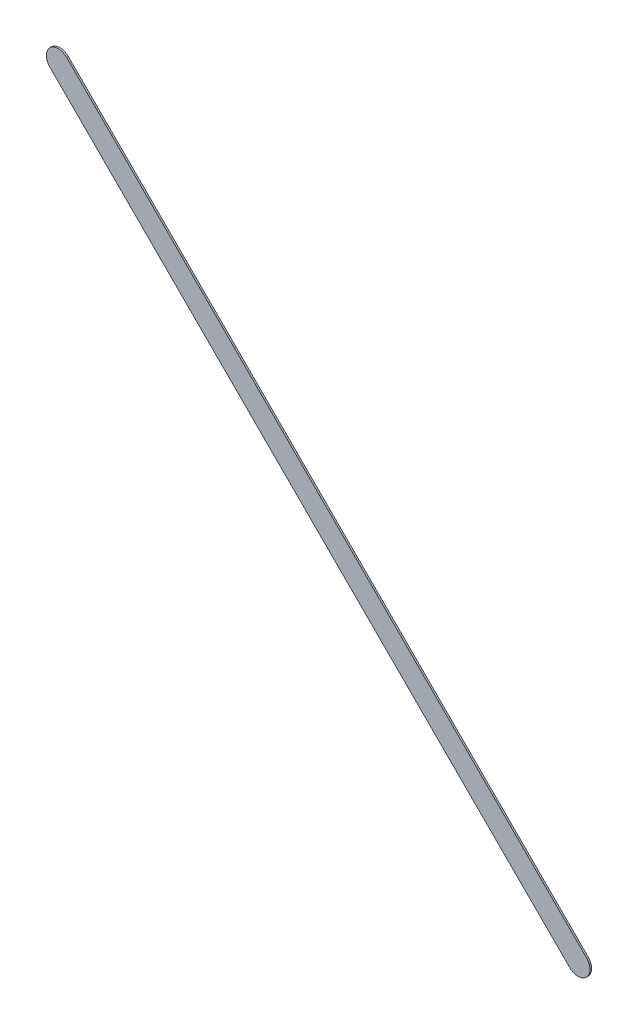
ISO-10303-21;
HEADER;
FILE_DESCRIPTION(('STEP AP214'),'2;1');
FILE_NAME('part.step','',(''),(''),'','','');
FILE_SCHEMA(('AUTOMOTIVE_DESIGN { 1 0 10303 214 1 1 1 1 }'));
ENDSEC;
DATA;
#1=APPLICATION_CONTEXT('core data for automotive mechanical design processes');
#2=APPLICATION_PROTOCOL_DEFINITION('international standard','automotive_design',2000,#1);
#3=PRODUCT_CONTEXT('',#1,'mechanical');
#4=PRODUCT('Part','Part','',(#3));
#5=PRODUCT_RELATED_PRODUCT_CATEGORY('part','',(#4));
#6=PRODUCT_DEFINITION_FORMATION('','',#4);
#7=PRODUCT_DEFINITION_CONTEXT('part definition',#1,'design');
#8=PRODUCT_DEFINITION('design','',#6,#7);
#9=PRODUCT_DEFINITION_SHAPE('','',#8);
#10=(LENGTH_UNIT() NAMED_UNIT(*) SI_UNIT(.MILLI.,.METRE.));
#11=(NAMED_UNIT(*) PLANE_ANGLE_UNIT() SI_UNIT($,.RADIAN.));
#12=(NAMED_UNIT(*) SI_UNIT($,.STERADIAN.) SOLID_ANGLE_UNIT());
#13=UNCERTAINTY_MEASURE_WITH_UNIT(LENGTH_MEASURE(1.E-05),#10,'distance_accuracy_value','');
#14=(GEOMETRIC_REPRESENTATION_CONTEXT(3) GLOBAL_UNCERTAINTY_ASSIGNED_CONTEXT((#13)) GLOBAL_UNIT_ASSIGNED_CONTEXT((#10,
#11,#12)) REPRESENTATION_CONTEXT('',''));
#15=CARTESIAN_POINT('',(0.,0.,0.));
#16=DIRECTION('',(0.,0.,1.));
#17=DIRECTION('',(1.,0.,0.));
#18=AXIS2_PLACEMENT_3D('',#15,#16,#17);
#19=CARTESIAN_POINT('',(163.498776,-116.790223,0.));
#20=DIRECTION('',(0.,0.,1.));
#21=DIRECTION('',(1.,0.,0.));
#22=AXIS2_PLACEMENT_3D('',#19,#20,#21);
#23=PLANE('',#22);
#24=DIRECTION('',(-0.707106781186548,0.707106781186548,0.));
#25=VECTOR('',#24,1.);
#26=CARTESIAN_POINT('',(163.498776,-116.790223,0.));
#27=LINE('',#26,#25);
#28=CARTESIAN_POINT('',(163.498776,-116.790223,0.));
#29=VERTEX_POINT('',#28);
#30=CARTESIAN_POINT('',(152.576776,-105.868223,0.));
#31=VERTEX_POINT('',#30);
#32=EDGE_CURVE('E85',#29,#31,#27,.T.);
#33=ORIENTED_EDGE('',*,*,#32,.T.);
#34=CARTESIAN_POINT('',(152.3999995,-106.0449995,0.));
#35=DIRECTION('',(0.,0.,1.));
#36=DIRECTION('',(0.707106781186548,0.707106781186548,0.));
#37=AXIS2_PLACEMENT_3D('',#34,#35,#36);
#38=CIRCLE('',#37,0.249999723809);
#39=CARTESIAN_POINT('',(152.223223,-106.221776,0.));
#40=VERTEX_POINT('',#39);
#41=EDGE_CURVE('E71',#31,#40,#38,.T.);
#42=ORIENTED_EDGE('',*,*,#41,.T.);
#43=DIRECTION('',(0.707106781186548,-0.707106781186548,0.));
#44=VECTOR('',#43,1.);
#45=CARTESIAN_POINT('',(152.223223,-106.221776,0.));
#46=LINE('',#45,#44);
#47=CARTESIAN_POINT('',(163.145223,-117.143776,0.));
#48=VERTEX_POINT('',#47);
#49=EDGE_CURVE('E106',#40,#48,#46,.T.);
#50=ORIENTED_EDGE('',*,*,#49,.T.);
#51=CARTESIAN_POINT('',(163.3219995,-116.9669995,0.));
#52=DIRECTION('',(0.,0.,1.));
#53=DIRECTION('',(-0.707106781186548,-0.707106781186548,0.));
#54=AXIS2_PLACEMENT_3D('',#51,#52,#53);
#55=CIRCLE('',#54,0.249999723809);
#56=EDGE_CURVE('E11',#48,#29,#55,.T.);
#57=ORIENTED_EDGE('',*,*,#56,.T.);
#58=EDGE_LOOP('',(#33,#42,#50,#57));
#59=FACE_BOUND('',#58,.T.);
#60=ADVANCED_FACE('F17',(#59),#23,.T.);
#61=CARTESIAN_POINT('',(163.498776,-116.790223,-0.035));
#62=DIRECTION('',(0.,0.,1.));
#63=DIRECTION('',(1.,0.,0.));
#64=AXIS2_PLACEMENT_3D('',#61,#62,#63);
#65=PLANE('',#64);
#66=CARTESIAN_POINT('',(163.3219995,-116.9669995,-0.035));
#67=DIRECTION('',(0.,0.,1.));
#68=DIRECTION('',(-0.707106781186548,-0.707106781186548,0.));
#69=AXIS2_PLACEMENT_3D('',#66,#67,#68);
#70=CIRCLE('',#69,0.249999723809);
#71=CARTESIAN_POINT('',(163.145223,-117.143776,-0.035));
#72=VERTEX_POINT('',#71);
#73=CARTESIAN_POINT('',(163.498776,-116.790223,-0.035));
#74=VERTEX_POINT('',#73);
#75=EDGE_CURVE('E20',#72,#74,#70,.T.);
#76=ORIENTED_EDGE('',*,*,#75,.F.);
#77=DIRECTION('',(0.707106781186548,-0.707106781186548,0.));
#78=VECTOR('',#77,1.);
#79=CARTESIAN_POINT('',(152.223223,-106.221776,-0.035));
#80=LINE('',#79,#78);
#81=CARTESIAN_POINT('',(152.223223,-106.221776,-0.035));
#82=VERTEX_POINT('',#81);
#83=EDGE_CURVE('E82',#82,#72,#80,.T.);
#84=ORIENTED_EDGE('',*,*,#83,.F.);
#85=CARTESIAN_POINT('',(152.3999995,-106.0449995,-0.035));
#86=DIRECTION('',(0.,0.,1.));
#87=DIRECTION('',(0.707106781186548,0.707106781186548,0.));
#88=AXIS2_PLACEMENT_3D('',#85,#86,#87);
#89=CIRCLE('',#88,0.249999723809);
#90=CARTESIAN_POINT('',(152.576776,-105.868223,-0.035));
#91=VERTEX_POINT('',#90);
#92=EDGE_CURVE('E109',#91,#82,#89,.T.);
#93=ORIENTED_EDGE('',*,*,#92,.F.);
#94=DIRECTION('',(-0.707106781186548,0.707106781186548,0.));
#95=VECTOR('',#94,1.);
#96=CARTESIAN_POINT('',(163.498776,-116.790223,-0.035));
#97=LINE('',#96,#95);
#98=EDGE_CURVE('E92',#74,#91,#97,.T.);
#99=ORIENTED_EDGE('',*,*,#98,.F.);
#100=EDGE_LOOP('',(#76,#84,#93,#99));
#101=FACE_BOUND('',#100,.T.);
#102=ADVANCED_FACE('F121',(#101),#65,.F.);
#103=CARTESIAN_POINT('',(163.3219995,-116.9669995,-0.035));
#104=DIRECTION('',(0.,0.,-1.));
#105=DIRECTION('',(-0.707106781186548,-0.707106781186548,0.));
#106=AXIS2_PLACEMENT_3D('',#103,#104,#105);
#107=CYLINDRICAL_SURFACE('',#106,0.249999723809);
#108=ORIENTED_EDGE('',*,*,#75,.T.);
#109=DIRECTION('',(0.,0.,1.));
#110=VECTOR('',#109,1.);
#111=CARTESIAN_POINT('',(163.498776,-116.790223,-0.035));
#112=LINE('',#111,#110);
#113=EDGE_CURVE('E89',#74,#29,#112,.T.);
#114=ORIENTED_EDGE('',*,*,#113,.T.);
#115=ORIENTED_EDGE('',*,*,#56,.F.);
#116=DIRECTION('',(0.,0.,1.));
#117=VECTOR('',#116,1.);
#118=CARTESIAN_POINT('',(163.145223,-117.143776,-0.035));
#119=LINE('',#118,#117);
#120=EDGE_CURVE('E102',#72,#48,#119,.T.);
#121=ORIENTED_EDGE('',*,*,#120,.F.);
#122=EDGE_LOOP('',(#108,#114,#115,#121));
#123=FACE_BOUND('',#122,.T.);
#124=ADVANCED_FACE('F119',(#123),#107,.T.);
#125=CARTESIAN_POINT('',(152.223223,-106.221776,-0.035));
#126=DIRECTION('',(0.707106781186548,0.707106781186548,0.));
#127=DIRECTION('',(0.,0.,-1.));
#128=AXIS2_PLACEMENT_3D('',#125,#126,#127);
#129=PLANE('',#128);
#130=ORIENTED_EDGE('',*,*,#83,.T.);
#131=ORIENTED_EDGE('',*,*,#120,.T.);
#132=ORIENTED_EDGE('',*,*,#49,.F.);
#133=DIRECTION('',(0.,0.,1.));
#134=VECTOR('',#133,1.);
#135=CARTESIAN_POINT('',(152.223223,-106.221776,-0.035));
#136=LINE('',#135,#134);
#137=EDGE_CURVE('E79',#82,#40,#136,.T.);
#138=ORIENTED_EDGE('',*,*,#137,.F.);
#139=EDGE_LOOP('',(#130,#131,#132,#138));
#140=FACE_BOUND('',#139,.T.);
#141=ADVANCED_FACE('F124',(#140),#129,.F.);
#142=CARTESIAN_POINT('',(152.3999995,-106.0449995,-0.035));
#143=DIRECTION('',(0.,0.,-1.));
#144=DIRECTION('',(0.707106781186548,0.707106781186548,0.));
#145=AXIS2_PLACEMENT_3D('',#142,#143,#144);
#146=CYLINDRICAL_SURFACE('',#145,0.249999723809);
#147=ORIENTED_EDGE('',*,*,#92,.T.);
#148=ORIENTED_EDGE('',*,*,#137,.T.);
#149=ORIENTED_EDGE('',*,*,#41,.F.);
#150=DIRECTION('',(0.,0.,1.));
#151=VECTOR('',#150,1.);
#152=CARTESIAN_POINT('',(152.576776,-105.868223,-0.035));
#153=LINE('',#152,#151);
#154=EDGE_CURVE('E76',#91,#31,#153,.T.);
#155=ORIENTED_EDGE('',*,*,#154,.F.);
#156=EDGE_LOOP('',(#147,#148,#149,#155));
#157=FACE_BOUND('',#156,.T.);
#158=ADVANCED_FACE('F74',(#157),#146,.T.);
#159=CARTESIAN_POINT('',(163.498776,-116.790223,-0.035));
#160=DIRECTION('',(-0.707106781186548,-0.707106781186548,0.));
#161=DIRECTION('',(-0.707106781186548,0.707106781186548,0.));
#162=AXIS2_PLACEMENT_3D('',#159,#160,#161);
#163=PLANE('',#162);
#164=ORIENTED_EDGE('',*,*,#98,.T.);
#165=ORIENTED_EDGE('',*,*,#154,.T.);
#166=ORIENTED_EDGE('',*,*,#32,.F.);
#167=ORIENTED_EDGE('',*,*,#113,.F.);
#168=EDGE_LOOP('',(#164,#165,#166,#167));
#169=FACE_BOUND('',#168,.T.);
#170=ADVANCED_FACE('F91',(#169),#163,.F.);
#171=CLOSED_SHELL('',(#60,#102,#124,#141,#158,#170));
#172=MANIFOLD_SOLID_BREP('B1',#171);
#173=ADVANCED_BREP_SHAPE_REPRESENTATION('',(#18,#172),#14);
#174=SHAPE_DEFINITION_REPRESENTATION(#9,#173);
ENDSEC;
END-ISO-10303-21;
